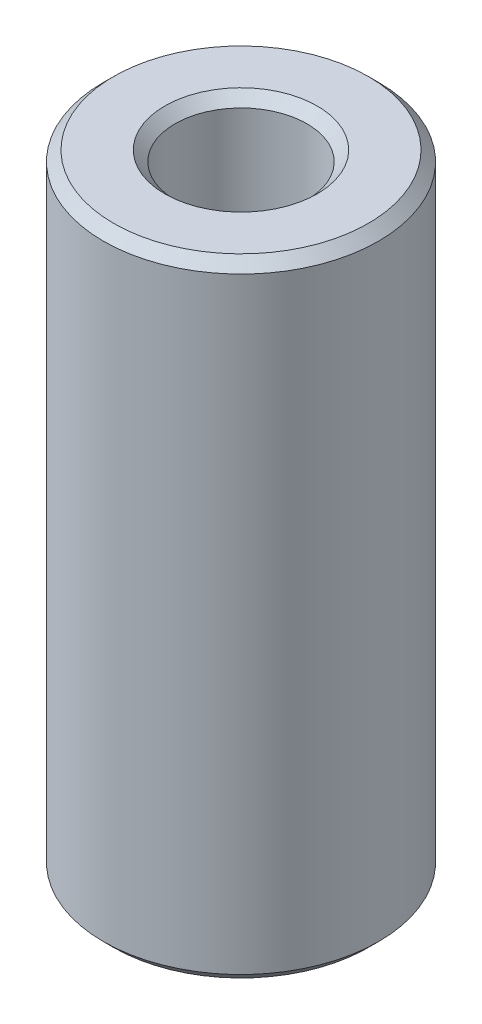
ISO-10303-21;
HEADER;
FILE_DESCRIPTION(('STEP AP214'),'2;1');
FILE_NAME('part.step','',(''),(''),'','','');
FILE_SCHEMA(('AUTOMOTIVE_DESIGN { 1 0 10303 214 1 1 1 1 }'));
ENDSEC;
DATA;
#1=APPLICATION_CONTEXT('core data for automotive mechanical design processes');
#2=APPLICATION_PROTOCOL_DEFINITION('international standard','automotive_design',2000,#1);
#3=PRODUCT_CONTEXT('',#1,'mechanical');
#4=PRODUCT('Part','Part','',(#3));
#5=PRODUCT_RELATED_PRODUCT_CATEGORY('part','',(#4));
#6=PRODUCT_DEFINITION_FORMATION('','',#4);
#7=PRODUCT_DEFINITION_CONTEXT('part definition',#1,'design');
#8=PRODUCT_DEFINITION('design','',#6,#7);
#9=PRODUCT_DEFINITION_SHAPE('','',#8);
#10=(LENGTH_UNIT() NAMED_UNIT(*) SI_UNIT(.MILLI.,.METRE.));
#11=(NAMED_UNIT(*) PLANE_ANGLE_UNIT() SI_UNIT($,.RADIAN.));
#12=(NAMED_UNIT(*) SI_UNIT($,.STERADIAN.) SOLID_ANGLE_UNIT());
#13=UNCERTAINTY_MEASURE_WITH_UNIT(LENGTH_MEASURE(1.E-05),#10,'distance_accuracy_value','');
#14=(GEOMETRIC_REPRESENTATION_CONTEXT(3) GLOBAL_UNCERTAINTY_ASSIGNED_CONTEXT((#13)) GLOBAL_UNIT_ASSIGNED_CONTEXT((#10,
#11,#12)) REPRESENTATION_CONTEXT('',''));
#15=CARTESIAN_POINT('',(0.,0.,0.));
#16=DIRECTION('',(0.,0.,1.));
#17=DIRECTION('',(1.,0.,0.));
#18=AXIS2_PLACEMENT_3D('',#15,#16,#17);
#19=CARTESIAN_POINT('',(0.,136.758334220998,0.));
#20=DIRECTION('',(0.,-1.,0.));
#21=DIRECTION('',(0.,0.,-1.));
#22=AXIS2_PLACEMENT_3D('',#19,#20,#21);
#23=CYLINDRICAL_SURFACE('',#22,30.);
#24=CARTESIAN_POINT('',(0.,2.23845228904504,0.));
#25=DIRECTION('',(0.,1.,0.));
#26=DIRECTION('',(0.,0.,1.));
#27=AXIS2_PLACEMENT_3D('',#24,#25,#26);
#28=CIRCLE('',#27,30.);
#29=CARTESIAN_POINT('',(0.,2.23845228904504,30.));
#30=VERTEX_POINT('',#29);
#31=EDGE_CURVE('E10',#30,#30,#28,.T.);
#32=ORIENTED_EDGE('',*,*,#31,.T.);
#33=EDGE_LOOP('',(#32));
#34=FACE_BOUND('',#33,.T.);
#35=CARTESIAN_POINT('',(0.,134.519881931953,0.));
#36=DIRECTION('',(0.,1.,0.));
#37=DIRECTION('',(0.,0.,1.));
#38=AXIS2_PLACEMENT_3D('',#35,#36,#37);
#39=CIRCLE('',#38,30.);
#40=CARTESIAN_POINT('',(0.,134.519881931953,30.));
#41=VERTEX_POINT('',#40);
#42=EDGE_CURVE('E50',#41,#41,#39,.F.);
#43=ORIENTED_EDGE('',*,*,#42,.T.);
#44=EDGE_LOOP('',(#43));
#45=FACE_BOUND('',#44,.T.);
#46=ADVANCED_FACE('F39',(#34,#45),#23,.T.);
#47=CARTESIAN_POINT('',(0.,136.758334220998,0.));
#48=DIRECTION('',(0.,1.,0.));
#49=DIRECTION('',(0.,0.,1.));
#50=AXIS2_PLACEMENT_3D('',#47,#48,#49);
#51=PLANE('',#50);
#52=CARTESIAN_POINT('',(0.,136.758334220998,0.));
#53=DIRECTION('',(0.,1.,0.));
#54=DIRECTION('',(0.,0.,1.));
#55=AXIS2_PLACEMENT_3D('',#52,#53,#54);
#56=CIRCLE('',#55,16.6148236826919);
#57=CARTESIAN_POINT('',(0.,136.758334220998,16.6148236826919));
#58=VERTEX_POINT('',#57);
#59=EDGE_CURVE('E58',#58,#58,#56,.F.);
#60=ORIENTED_EDGE('',*,*,#59,.T.);
#61=EDGE_LOOP('',(#60));
#62=FACE_BOUND('',#61,.T.);
#63=CARTESIAN_POINT('',(0.,136.758334220998,0.));
#64=DIRECTION('',(0.,1.,0.));
#65=DIRECTION('',(0.,0.,1.));
#66=AXIS2_PLACEMENT_3D('',#63,#64,#65);
#67=CIRCLE('',#66,27.7615477109549);
#68=CARTESIAN_POINT('',(0.,136.758334220998,27.7615477109549));
#69=VERTEX_POINT('',#68);
#70=EDGE_CURVE('E61',#69,#69,#67,.T.);
#71=ORIENTED_EDGE('',*,*,#70,.T.);
#72=EDGE_LOOP('',(#71));
#73=FACE_BOUND('',#72,.T.);
#74=ADVANCED_FACE('F88',(#62,#73),#51,.T.);
#75=CARTESIAN_POINT('',(0.,0.,0.));
#76=DIRECTION('',(0.,1.,0.));
#77=DIRECTION('',(0.,0.,1.));
#78=AXIS2_PLACEMENT_3D('',#75,#76,#77);
#79=PLANE('',#78);
#80=CARTESIAN_POINT('',(0.,0.,0.));
#81=DIRECTION('',(0.,1.,0.));
#82=DIRECTION('',(0.,0.,1.));
#83=AXIS2_PLACEMENT_3D('',#80,#81,#82);
#84=CIRCLE('',#83,16.614823682692);
#85=CARTESIAN_POINT('',(0.,0.,16.614823682692));
#86=VERTEX_POINT('',#85);
#87=EDGE_CURVE('E51',#86,#86,#84,.T.);
#88=ORIENTED_EDGE('',*,*,#87,.T.);
#89=EDGE_LOOP('',(#88));
#90=FACE_BOUND('',#89,.T.);
#91=CARTESIAN_POINT('',(0.,0.,0.));
#92=DIRECTION('',(0.,1.,0.));
#93=DIRECTION('',(0.,0.,1.));
#94=AXIS2_PLACEMENT_3D('',#91,#92,#93);
#95=CIRCLE('',#94,27.7615477109549);
#96=CARTESIAN_POINT('',(0.,0.,27.7615477109549));
#97=VERTEX_POINT('',#96);
#98=EDGE_CURVE('E54',#97,#97,#95,.F.);
#99=ORIENTED_EDGE('',*,*,#98,.T.);
#100=EDGE_LOOP('',(#99));
#101=FACE_BOUND('',#100,.T.);
#102=ADVANCED_FACE('F83',(#90,#101),#79,.F.);
#103=CARTESIAN_POINT('',(0.,136.758334220998,0.));
#104=DIRECTION('',(0.,-1.,0.));
#105=DIRECTION('',(0.,0.,-1.));
#106=AXIS2_PLACEMENT_3D('',#103,#104,#105);
#107=CYLINDRICAL_SURFACE('',#106,14.376371393647);
#108=CARTESIAN_POINT('',(0.,134.519881931953,0.));
#109=DIRECTION('',(0.,1.,0.));
#110=DIRECTION('',(0.,0.,1.));
#111=AXIS2_PLACEMENT_3D('',#108,#109,#110);
#112=CIRCLE('',#111,14.376371393647);
#113=CARTESIAN_POINT('',(0.,134.519881931953,14.376371393647));
#114=VERTEX_POINT('',#113);
#115=EDGE_CURVE('E67',#114,#114,#112,.T.);
#116=ORIENTED_EDGE('',*,*,#115,.T.);
#117=EDGE_LOOP('',(#116));
#118=FACE_BOUND('',#117,.T.);
#119=CARTESIAN_POINT('',(0.,2.23845228904504,0.));
#120=DIRECTION('',(0.,1.,0.));
#121=DIRECTION('',(0.,0.,1.));
#122=AXIS2_PLACEMENT_3D('',#119,#120,#121);
#123=CIRCLE('',#122,14.376371393647);
#124=CARTESIAN_POINT('',(0.,2.23845228904504,14.376371393647));
#125=VERTEX_POINT('',#124);
#126=EDGE_CURVE('E69',#125,#125,#123,.F.);
#127=ORIENTED_EDGE('',*,*,#126,.T.);
#128=EDGE_LOOP('',(#127));
#129=FACE_BOUND('',#128,.T.);
#130=ADVANCED_FACE('F71',(#118,#129),#107,.F.);
#131=CARTESIAN_POINT('',(0.,134.519881931953,0.));
#132=DIRECTION('',(0.,1.,0.));
#133=DIRECTION('',(0.,0.,1.));
#134=AXIS2_PLACEMENT_3D('',#131,#132,#133);
#135=CONICAL_SURFACE('',#134,14.376371393647,0.785398163397444);
#136=ORIENTED_EDGE('',*,*,#59,.F.);
#137=EDGE_LOOP('',(#136));
#138=FACE_BOUND('',#137,.T.);
#139=ORIENTED_EDGE('',*,*,#115,.F.);
#140=EDGE_LOOP('',(#139));
#141=FACE_BOUND('',#140,.T.);
#142=ADVANCED_FACE('F77',(#138,#141),#135,.F.);
#143=CARTESIAN_POINT('',(0.,0.,0.));
#144=DIRECTION('',(0.,-1.,0.));
#145=DIRECTION('',(0.,0.,-1.));
#146=AXIS2_PLACEMENT_3D('',#143,#144,#145);
#147=CONICAL_SURFACE('',#146,16.614823682692,0.785398163397444);
#148=ORIENTED_EDGE('',*,*,#126,.F.);
#149=EDGE_LOOP('',(#148));
#150=FACE_BOUND('',#149,.T.);
#151=ORIENTED_EDGE('',*,*,#87,.F.);
#152=EDGE_LOOP('',(#151));
#153=FACE_BOUND('',#152,.T.);
#154=ADVANCED_FACE('F73',(#150,#153),#147,.F.);
#155=CARTESIAN_POINT('',(0.,2.23845228904504,0.));
#156=DIRECTION('',(0.,1.,0.));
#157=DIRECTION('',(0.,0.,1.));
#158=AXIS2_PLACEMENT_3D('',#155,#156,#157);
#159=CONICAL_SURFACE('',#158,30.,0.785398163397451);
#160=ORIENTED_EDGE('',*,*,#98,.F.);
#161=EDGE_LOOP('',(#160));
#162=FACE_BOUND('',#161,.T.);
#163=ORIENTED_EDGE('',*,*,#31,.F.);
#164=EDGE_LOOP('',(#163));
#165=FACE_BOUND('',#164,.T.);
#166=ADVANCED_FACE('F76',(#162,#165),#159,.T.);
#167=CARTESIAN_POINT('',(0.,136.758334220998,0.));
#168=DIRECTION('',(0.,-1.,0.));
#169=DIRECTION('',(0.,0.,-1.));
#170=AXIS2_PLACEMENT_3D('',#167,#168,#169);
#171=CONICAL_SURFACE('',#170,27.7615477109549,0.785398163397433);
#172=ORIENTED_EDGE('',*,*,#42,.F.);
#173=EDGE_LOOP('',(#172));
#174=FACE_BOUND('',#173,.T.);
#175=ORIENTED_EDGE('',*,*,#70,.F.);
#176=EDGE_LOOP('',(#175));
#177=FACE_BOUND('',#176,.T.);
#178=ADVANCED_FACE('F45',(#174,#177),#171,.T.);
#179=CLOSED_SHELL('',(#46,#74,#102,#130,#142,#154,#166,#178));
#180=MANIFOLD_SOLID_BREP('B2',#179);
#181=ADVANCED_BREP_SHAPE_REPRESENTATION('',(#18,#180),#14);
#182=SHAPE_DEFINITION_REPRESENTATION(#9,#181);
ENDSEC;
END-ISO-10303-21;
